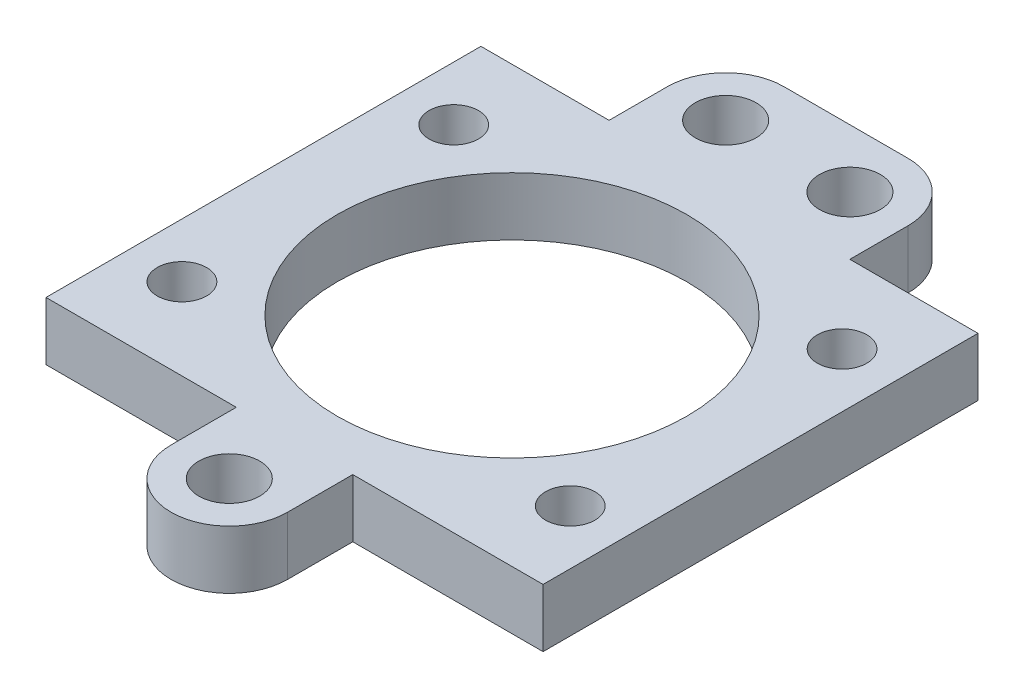
ISO-10303-21;
HEADER;
FILE_DESCRIPTION(('STEP AP214'),'2;1');
FILE_NAME('part.step','',(''),(''),'','','');
FILE_SCHEMA(('AUTOMOTIVE_DESIGN { 1 0 10303 214 1 1 1 1 }'));
ENDSEC;
DATA;
#1=APPLICATION_CONTEXT('core data for automotive mechanical design processes');
#2=APPLICATION_PROTOCOL_DEFINITION('international standard','automotive_design',2000,#1);
#3=PRODUCT_CONTEXT('',#1,'mechanical');
#4=PRODUCT('Part','Part','',(#3));
#5=PRODUCT_RELATED_PRODUCT_CATEGORY('part','',(#4));
#6=PRODUCT_DEFINITION_FORMATION('','',#4);
#7=PRODUCT_DEFINITION_CONTEXT('part definition',#1,'design');
#8=PRODUCT_DEFINITION('design','',#6,#7);
#9=PRODUCT_DEFINITION_SHAPE('','',#8);
#10=(LENGTH_UNIT() NAMED_UNIT(*) SI_UNIT(.MILLI.,.METRE.));
#11=(NAMED_UNIT(*) PLANE_ANGLE_UNIT() SI_UNIT($,.RADIAN.));
#12=(NAMED_UNIT(*) SI_UNIT($,.STERADIAN.) SOLID_ANGLE_UNIT());
#13=UNCERTAINTY_MEASURE_WITH_UNIT(LENGTH_MEASURE(1.E-05),#10,'distance_accuracy_value','');
#14=(GEOMETRIC_REPRESENTATION_CONTEXT(3) GLOBAL_UNCERTAINTY_ASSIGNED_CONTEXT((#13)) GLOBAL_UNIT_ASSIGNED_CONTEXT((#10,
#11,#12)) REPRESENTATION_CONTEXT('',''));
#15=CARTESIAN_POINT('',(0.,0.,0.));
#16=DIRECTION('',(0.,0.,1.));
#17=DIRECTION('',(1.,0.,0.));
#18=AXIS2_PLACEMENT_3D('',#15,#16,#17);
#19=CARTESIAN_POINT('',(0.,3.175,0.));
#20=DIRECTION('',(0.,1.,0.));
#21=DIRECTION('',(0.,0.,1.));
#22=AXIS2_PLACEMENT_3D('',#19,#20,#21);
#23=PLANE('',#22);
#24=CARTESIAN_POINT('',(0.,3.175,0.));
#25=DIRECTION('',(0.,-1.,0.));
#26=DIRECTION('',(0.,0.,-1.));
#27=AXIS2_PLACEMENT_3D('',#24,#25,#26);
#28=CIRCLE('',#27,14.2875);
#29=CARTESIAN_POINT('',(0.,3.175,-14.2875));
#30=VERTEX_POINT('',#29);
#31=EDGE_CURVE('E216',#30,#30,#28,.T.);
#32=ORIENTED_EDGE('',*,*,#31,.T.);
#33=EDGE_LOOP('',(#32));
#34=FACE_BOUND('',#33,.T.);
#35=CARTESIAN_POINT('',(5.08,3.175,-22.5488491058857));
#36=DIRECTION('',(0.,1.,0.));
#37=DIRECTION('',(0.,0.,1.));
#38=AXIS2_PLACEMENT_3D('',#35,#36,#37);
#39=CIRCLE('',#38,2.4892);
#40=CARTESIAN_POINT('',(5.08,3.175,-20.0596491058857));
#41=VERTEX_POINT('',#40);
#42=EDGE_CURVE('E339',#41,#41,#39,.T.);
#43=ORIENTED_EDGE('',*,*,#42,.F.);
#44=EDGE_LOOP('',(#43));
#45=FACE_BOUND('',#44,.T.);
#46=CARTESIAN_POINT('',(-5.08,3.175,-22.5488491058857));
#47=DIRECTION('',(0.,1.,0.));
#48=DIRECTION('',(0.,0.,1.));
#49=AXIS2_PLACEMENT_3D('',#46,#47,#48);
#50=CIRCLE('',#49,2.4892);
#51=CARTESIAN_POINT('',(-5.08,3.175,-20.0596491058857));
#52=VERTEX_POINT('',#51);
#53=EDGE_CURVE('E50',#52,#52,#50,.T.);
#54=ORIENTED_EDGE('',*,*,#53,.F.);
#55=EDGE_LOOP('',(#54));
#56=FACE_BOUND('',#55,.T.);
#57=CARTESIAN_POINT('',(0.,3.175,23.114));
#58=DIRECTION('',(0.,1.,0.));
#59=DIRECTION('',(0.,0.,1.));
#60=AXIS2_PLACEMENT_3D('',#57,#58,#59);
#61=CIRCLE('',#60,2.4892);
#62=CARTESIAN_POINT('',(0.,3.175,25.6032));
#63=VERTEX_POINT('',#62);
#64=EDGE_CURVE('E12',#63,#63,#61,.T.);
#65=ORIENTED_EDGE('',*,*,#64,.F.);
#66=EDGE_LOOP('',(#65));
#67=FACE_BOUND('',#66,.T.);
#68=CARTESIAN_POINT('',(-15.875,3.175,11.1125));
#69=DIRECTION('',(0.,-1.,0.));
#70=DIRECTION('',(0.,0.,-1.));
#71=AXIS2_PLACEMENT_3D('',#68,#69,#70);
#72=CIRCLE('',#71,2.0193);
#73=CARTESIAN_POINT('',(-15.875,3.175,9.0932));
#74=VERTEX_POINT('',#73);
#75=EDGE_CURVE('E329',#74,#74,#72,.T.);
#76=ORIENTED_EDGE('',*,*,#75,.T.);
#77=EDGE_LOOP('',(#76));
#78=FACE_BOUND('',#77,.T.);
#79=CARTESIAN_POINT('',(15.875,3.175,11.1125));
#80=DIRECTION('',(0.,-1.,0.));
#81=DIRECTION('',(0.,0.,-1.));
#82=AXIS2_PLACEMENT_3D('',#79,#80,#81);
#83=CIRCLE('',#82,2.0193);
#84=CARTESIAN_POINT('',(15.875,3.175,9.0932));
#85=VERTEX_POINT('',#84);
#86=EDGE_CURVE('E325',#85,#85,#83,.T.);
#87=ORIENTED_EDGE('',*,*,#86,.T.);
#88=EDGE_LOOP('',(#87));
#89=FACE_BOUND('',#88,.T.);
#90=CARTESIAN_POINT('',(15.875,3.175,-11.1125));
#91=DIRECTION('',(0.,-1.,0.));
#92=DIRECTION('',(0.,0.,-1.));
#93=AXIS2_PLACEMENT_3D('',#90,#91,#92);
#94=CIRCLE('',#93,2.0193);
#95=CARTESIAN_POINT('',(15.875,3.175,-13.1318));
#96=VERTEX_POINT('',#95);
#97=EDGE_CURVE('E330',#96,#96,#94,.T.);
#98=ORIENTED_EDGE('',*,*,#97,.T.);
#99=EDGE_LOOP('',(#98));
#100=FACE_BOUND('',#99,.T.);
#101=CARTESIAN_POINT('',(-15.875,3.175,-11.1125));
#102=DIRECTION('',(0.,-1.,0.));
#103=DIRECTION('',(0.,0.,-1.));
#104=AXIS2_PLACEMENT_3D('',#101,#102,#103);
#105=CIRCLE('',#104,2.0193);
#106=CARTESIAN_POINT('',(-15.875,3.175,-13.1318));
#107=VERTEX_POINT('',#106);
#108=EDGE_CURVE('E324',#107,#107,#105,.T.);
#109=ORIENTED_EDGE('',*,*,#108,.T.);
#110=EDGE_LOOP('',(#109));
#111=FACE_BOUND('',#110,.T.);
#112=DIRECTION('',(0.,0.,-1.));
#113=VECTOR('',#112,1.);
#114=CARTESIAN_POINT('',(-20.32,3.175,17.78));
#115=LINE('',#114,#113);
#116=CARTESIAN_POINT('',(-20.32,3.175,17.78));
#117=VERTEX_POINT('',#116);
#118=CARTESIAN_POINT('',(-20.32,3.175,-17.78));
#119=VERTEX_POINT('',#118);
#120=EDGE_CURVE('E163',#117,#119,#115,.T.);
#121=ORIENTED_EDGE('',*,*,#120,.F.);
#122=DIRECTION('',(-1.,0.,0.));
#123=VECTOR('',#122,1.);
#124=CARTESIAN_POINT('',(-20.32,3.175,17.78));
#125=LINE('',#124,#123);
#126=CARTESIAN_POINT('',(-4.7625,3.175,17.78));
#127=VERTEX_POINT('',#126);
#128=EDGE_CURVE('E58',#127,#117,#125,.T.);
#129=ORIENTED_EDGE('',*,*,#128,.F.);
#130=DIRECTION('',(0.,0.,-1.));
#131=VECTOR('',#130,1.);
#132=CARTESIAN_POINT('',(-4.7625,3.175,17.78));
#133=LINE('',#132,#131);
#134=CARTESIAN_POINT('',(-4.7625,3.175,23.114));
#135=VERTEX_POINT('',#134);
#136=EDGE_CURVE('E206',#135,#127,#133,.T.);
#137=ORIENTED_EDGE('',*,*,#136,.F.);
#138=CARTESIAN_POINT('',(0.,3.175,23.114));
#139=DIRECTION('',(0.,-1.,0.));
#140=DIRECTION('',(0.,0.,1.));
#141=AXIS2_PLACEMENT_3D('',#138,#139,#140);
#142=CIRCLE('',#141,4.7625);
#143=CARTESIAN_POINT('',(4.7625,3.175,23.114));
#144=VERTEX_POINT('',#143);
#145=EDGE_CURVE('E202',#144,#135,#142,.T.);
#146=ORIENTED_EDGE('',*,*,#145,.F.);
#147=DIRECTION('',(0.,0.,1.));
#148=VECTOR('',#147,1.);
#149=CARTESIAN_POINT('',(4.7625,3.175,23.114));
#150=LINE('',#149,#148);
#151=CARTESIAN_POINT('',(4.7625,3.175,17.78));
#152=VERTEX_POINT('',#151);
#153=EDGE_CURVE('E198',#152,#144,#150,.T.);
#154=ORIENTED_EDGE('',*,*,#153,.F.);
#155=DIRECTION('',(-1.,0.,0.));
#156=VECTOR('',#155,1.);
#157=CARTESIAN_POINT('',(4.7625,3.175,17.78));
#158=LINE('',#157,#156);
#159=CARTESIAN_POINT('',(20.32,3.175,17.78));
#160=VERTEX_POINT('',#159);
#161=EDGE_CURVE('E194',#160,#152,#158,.T.);
#162=ORIENTED_EDGE('',*,*,#161,.F.);
#163=DIRECTION('',(0.,0.,1.));
#164=VECTOR('',#163,1.);
#165=CARTESIAN_POINT('',(20.32,3.175,-17.78));
#166=LINE('',#165,#164);
#167=CARTESIAN_POINT('',(20.32,3.175,-17.78));
#168=VERTEX_POINT('',#167);
#169=EDGE_CURVE('E190',#168,#160,#166,.T.);
#170=ORIENTED_EDGE('',*,*,#169,.F.);
#171=DIRECTION('',(1.,0.,0.));
#172=VECTOR('',#171,1.);
#173=CARTESIAN_POINT('',(9.8425,3.175,-17.78));
#174=LINE('',#173,#172);
#175=CARTESIAN_POINT('',(9.8425,3.175,-17.78));
#176=VERTEX_POINT('',#175);
#177=EDGE_CURVE('E186',#176,#168,#174,.T.);
#178=ORIENTED_EDGE('',*,*,#177,.F.);
#179=DIRECTION('',(0.,0.,1.));
#180=VECTOR('',#179,1.);
#181=CARTESIAN_POINT('',(9.8425,3.175,-22.5488491058857));
#182=LINE('',#181,#180);
#183=CARTESIAN_POINT('',(9.8425,3.175,-22.5488491058857));
#184=VERTEX_POINT('',#183);
#185=EDGE_CURVE('E182',#184,#176,#182,.T.);
#186=ORIENTED_EDGE('',*,*,#185,.F.);
#187=CARTESIAN_POINT('',(5.08,3.175,-22.5488491058857));
#188=DIRECTION('',(0.,-1.,0.));
#189=DIRECTION('',(0.,0.,-1.));
#190=AXIS2_PLACEMENT_3D('',#187,#188,#189);
#191=CIRCLE('',#190,4.7625);
#192=CARTESIAN_POINT('',(5.08,3.175,-27.3113491058857));
#193=VERTEX_POINT('',#192);
#194=EDGE_CURVE('E178',#193,#184,#191,.T.);
#195=ORIENTED_EDGE('',*,*,#194,.F.);
#196=DIRECTION('',(1.,0.,0.));
#197=VECTOR('',#196,1.);
#198=CARTESIAN_POINT('',(-5.08,3.175,-27.3113491058857));
#199=LINE('',#198,#197);
#200=CARTESIAN_POINT('',(-5.08,3.175,-27.3113491058857));
#201=VERTEX_POINT('',#200);
#202=EDGE_CURVE('E171',#201,#193,#199,.T.);
#203=ORIENTED_EDGE('',*,*,#202,.F.);
#204=CARTESIAN_POINT('',(-5.08,3.175,-22.5488491058857));
#205=DIRECTION('',(0.,-1.,0.));
#206=DIRECTION('',(0.,0.,1.));
#207=AXIS2_PLACEMENT_3D('',#204,#205,#206);
#208=CIRCLE('',#207,4.7625);
#209=CARTESIAN_POINT('',(-9.8425,3.175,-22.5488491058857));
#210=VERTEX_POINT('',#209);
#211=EDGE_CURVE('E167',#210,#201,#208,.T.);
#212=ORIENTED_EDGE('',*,*,#211,.F.);
#213=DIRECTION('',(0.,0.,-1.));
#214=VECTOR('',#213,1.);
#215=CARTESIAN_POINT('',(-9.84250000000001,3.175,-17.78));
#216=LINE('',#215,#214);
#217=CARTESIAN_POINT('',(-9.84250000000001,3.175,-17.78));
#218=VERTEX_POINT('',#217);
#219=EDGE_CURVE('E148',#218,#210,#216,.T.);
#220=ORIENTED_EDGE('',*,*,#219,.F.);
#221=DIRECTION('',(1.,0.,0.));
#222=VECTOR('',#221,1.);
#223=CARTESIAN_POINT('',(-20.32,3.175,-17.78));
#224=LINE('',#223,#222);
#225=EDGE_CURVE('E157',#119,#218,#224,.T.);
#226=ORIENTED_EDGE('',*,*,#225,.F.);
#227=EDGE_LOOP('',(#121,#129,#137,#146,#154,#162,#170,#178,#186,#195,#203,#212,#220,#226));
#228=FACE_BOUND('',#227,.T.);
#229=ADVANCED_FACE('F41',(#34,#45,#56,#67,#78,#89,#100,#111,#228),#23,.T.);
#230=CARTESIAN_POINT('',(0.,-1.5875,0.));
#231=DIRECTION('',(0.,1.,0.));
#232=DIRECTION('',(0.,0.,1.));
#233=AXIS2_PLACEMENT_3D('',#230,#231,#232);
#234=PLANE('',#233);
#235=CARTESIAN_POINT('',(0.,-1.5875,0.));
#236=DIRECTION('',(0.,-1.,0.));
#237=DIRECTION('',(0.,0.,-1.));
#238=AXIS2_PLACEMENT_3D('',#235,#236,#237);
#239=CIRCLE('',#238,14.2875);
#240=CARTESIAN_POINT('',(0.,-1.5875,-14.2875));
#241=VERTEX_POINT('',#240);
#242=EDGE_CURVE('E425',#241,#241,#239,.T.);
#243=ORIENTED_EDGE('',*,*,#242,.F.);
#244=EDGE_LOOP('',(#243));
#245=FACE_BOUND('',#244,.T.);
#246=CARTESIAN_POINT('',(5.08,-1.5875,-22.5488491058857));
#247=DIRECTION('',(0.,1.,0.));
#248=DIRECTION('',(0.,0.,1.));
#249=AXIS2_PLACEMENT_3D('',#246,#247,#248);
#250=CIRCLE('',#249,2.4892);
#251=CARTESIAN_POINT('',(5.08,-1.5875,-20.0596491058857));
#252=VERTEX_POINT('',#251);
#253=EDGE_CURVE('E320',#252,#252,#250,.F.);
#254=ORIENTED_EDGE('',*,*,#253,.F.);
#255=EDGE_LOOP('',(#254));
#256=FACE_BOUND('',#255,.T.);
#257=CARTESIAN_POINT('',(0.,-1.5875,23.114));
#258=DIRECTION('',(0.,1.,0.));
#259=DIRECTION('',(0.,0.,1.));
#260=AXIS2_PLACEMENT_3D('',#257,#258,#259);
#261=CIRCLE('',#260,2.4892);
#262=CARTESIAN_POINT('',(0.,-1.5875,25.6032));
#263=VERTEX_POINT('',#262);
#264=EDGE_CURVE('E312',#263,#263,#261,.F.);
#265=ORIENTED_EDGE('',*,*,#264,.F.);
#266=EDGE_LOOP('',(#265));
#267=FACE_BOUND('',#266,.T.);
#268=CARTESIAN_POINT('',(15.875,-1.5875,11.1125));
#269=DIRECTION('',(0.,1.,0.));
#270=DIRECTION('',(0.,0.,1.));
#271=AXIS2_PLACEMENT_3D('',#268,#269,#270);
#272=CIRCLE('',#271,2.0193);
#273=CARTESIAN_POINT('',(15.875,-1.5875,13.1318));
#274=VERTEX_POINT('',#273);
#275=EDGE_CURVE('E304',#274,#274,#272,.F.);
#276=ORIENTED_EDGE('',*,*,#275,.F.);
#277=EDGE_LOOP('',(#276));
#278=FACE_BOUND('',#277,.T.);
#279=CARTESIAN_POINT('',(-15.875,-1.5875,-11.1125));
#280=DIRECTION('',(0.,1.,0.));
#281=DIRECTION('',(0.,0.,1.));
#282=AXIS2_PLACEMENT_3D('',#279,#280,#281);
#283=CIRCLE('',#282,2.0193);
#284=CARTESIAN_POINT('',(-15.875,-1.5875,-9.0932));
#285=VERTEX_POINT('',#284);
#286=EDGE_CURVE('E44',#285,#285,#283,.F.);
#287=ORIENTED_EDGE('',*,*,#286,.F.);
#288=EDGE_LOOP('',(#287));
#289=FACE_BOUND('',#288,.T.);
#290=CARTESIAN_POINT('',(15.875,-1.5875,-11.1125));
#291=DIRECTION('',(0.,1.,0.));
#292=DIRECTION('',(0.,0.,1.));
#293=AXIS2_PLACEMENT_3D('',#290,#291,#292);
#294=CIRCLE('',#293,2.0193);
#295=CARTESIAN_POINT('',(15.875,-1.5875,-9.09319999999999));
#296=VERTEX_POINT('',#295);
#297=EDGE_CURVE('E300',#296,#296,#294,.F.);
#298=ORIENTED_EDGE('',*,*,#297,.F.);
#299=EDGE_LOOP('',(#298));
#300=FACE_BOUND('',#299,.T.);
#301=CARTESIAN_POINT('',(-15.875,-1.5875,11.1125));
#302=DIRECTION('',(0.,1.,0.));
#303=DIRECTION('',(0.,0.,1.));
#304=AXIS2_PLACEMENT_3D('',#301,#302,#303);
#305=CIRCLE('',#304,2.0193);
#306=CARTESIAN_POINT('',(-15.875,-1.5875,13.1318));
#307=VERTEX_POINT('',#306);
#308=EDGE_CURVE('E308',#307,#307,#305,.F.);
#309=ORIENTED_EDGE('',*,*,#308,.F.);
#310=EDGE_LOOP('',(#309));
#311=FACE_BOUND('',#310,.T.);
#312=CARTESIAN_POINT('',(-5.08,-1.5875,-22.5488491058857));
#313=DIRECTION('',(0.,1.,0.));
#314=DIRECTION('',(0.,0.,1.));
#315=AXIS2_PLACEMENT_3D('',#312,#313,#314);
#316=CIRCLE('',#315,2.4892);
#317=CARTESIAN_POINT('',(-5.08,-1.5875,-20.0596491058857));
#318=VERTEX_POINT('',#317);
#319=EDGE_CURVE('E316',#318,#318,#316,.F.);
#320=ORIENTED_EDGE('',*,*,#319,.F.);
#321=EDGE_LOOP('',(#320));
#322=FACE_BOUND('',#321,.T.);
#323=DIRECTION('',(-1.,0.,0.));
#324=VECTOR('',#323,1.);
#325=CARTESIAN_POINT('',(-20.32,-1.5875,17.78));
#326=LINE('',#325,#324);
#327=CARTESIAN_POINT('',(-4.7625,-1.5875,17.78));
#328=VERTEX_POINT('',#327);
#329=CARTESIAN_POINT('',(-20.32,-1.5875,17.78));
#330=VERTEX_POINT('',#329);
#331=EDGE_CURVE('E211',#328,#330,#326,.T.);
#332=ORIENTED_EDGE('',*,*,#331,.T.);
#333=DIRECTION('',(0.,0.,-1.));
#334=VECTOR('',#333,1.);
#335=CARTESIAN_POINT('',(-20.32,-1.5875,17.78));
#336=LINE('',#335,#334);
#337=CARTESIAN_POINT('',(-20.32,-1.5875,-17.78));
#338=VERTEX_POINT('',#337);
#339=EDGE_CURVE('E215',#330,#338,#336,.T.);
#340=ORIENTED_EDGE('',*,*,#339,.T.);
#341=DIRECTION('',(1.,0.,0.));
#342=VECTOR('',#341,1.);
#343=CARTESIAN_POINT('',(-20.32,-1.5875,-17.78));
#344=LINE('',#343,#342);
#345=CARTESIAN_POINT('',(-9.84250000000001,-1.5875,-17.78));
#346=VERTEX_POINT('',#345);
#347=EDGE_CURVE('E66',#338,#346,#344,.T.);
#348=ORIENTED_EDGE('',*,*,#347,.T.);
#349=DIRECTION('',(0.,0.,-1.));
#350=VECTOR('',#349,1.);
#351=CARTESIAN_POINT('',(-9.84250000000001,-1.5875,-17.78));
#352=LINE('',#351,#350);
#353=CARTESIAN_POINT('',(-9.8425,-1.5875,-22.5488491058857));
#354=VERTEX_POINT('',#353);
#355=EDGE_CURVE('E151',#346,#354,#352,.T.);
#356=ORIENTED_EDGE('',*,*,#355,.T.);
#357=CARTESIAN_POINT('',(-5.08,-1.5875,-22.5488491058857));
#358=DIRECTION('',(0.,-1.,0.));
#359=DIRECTION('',(0.,0.,1.));
#360=AXIS2_PLACEMENT_3D('',#357,#358,#359);
#361=CIRCLE('',#360,4.7625);
#362=CARTESIAN_POINT('',(-5.08,-1.5875,-27.3113491058857));
#363=VERTEX_POINT('',#362);
#364=EDGE_CURVE('E224',#354,#363,#361,.T.);
#365=ORIENTED_EDGE('',*,*,#364,.T.);
#366=DIRECTION('',(1.,0.,0.));
#367=VECTOR('',#366,1.);
#368=CARTESIAN_POINT('',(-5.08,-1.5875,-27.3113491058857));
#369=LINE('',#368,#367);
#370=CARTESIAN_POINT('',(5.08,-1.5875,-27.3113491058857));
#371=VERTEX_POINT('',#370);
#372=EDGE_CURVE('E228',#363,#371,#369,.T.);
#373=ORIENTED_EDGE('',*,*,#372,.T.);
#374=CARTESIAN_POINT('',(5.08,-1.5875,-22.5488491058857));
#375=DIRECTION('',(0.,-1.,0.));
#376=DIRECTION('',(0.,0.,-1.));
#377=AXIS2_PLACEMENT_3D('',#374,#375,#376);
#378=CIRCLE('',#377,4.7625);
#379=CARTESIAN_POINT('',(9.8425,-1.5875,-22.5488491058857));
#380=VERTEX_POINT('',#379);
#381=EDGE_CURVE('E232',#371,#380,#378,.T.);
#382=ORIENTED_EDGE('',*,*,#381,.T.);
#383=DIRECTION('',(0.,0.,1.));
#384=VECTOR('',#383,1.);
#385=CARTESIAN_POINT('',(9.8425,-1.5875,-22.5488491058857));
#386=LINE('',#385,#384);
#387=CARTESIAN_POINT('',(9.8425,-1.5875,-17.78));
#388=VERTEX_POINT('',#387);
#389=EDGE_CURVE('E236',#380,#388,#386,.T.);
#390=ORIENTED_EDGE('',*,*,#389,.T.);
#391=DIRECTION('',(1.,0.,0.));
#392=VECTOR('',#391,1.);
#393=CARTESIAN_POINT('',(9.8425,-1.5875,-17.78));
#394=LINE('',#393,#392);
#395=CARTESIAN_POINT('',(20.32,-1.5875,-17.78));
#396=VERTEX_POINT('',#395);
#397=EDGE_CURVE('E240',#388,#396,#394,.T.);
#398=ORIENTED_EDGE('',*,*,#397,.T.);
#399=DIRECTION('',(0.,0.,1.));
#400=VECTOR('',#399,1.);
#401=CARTESIAN_POINT('',(20.32,-1.5875,-17.78));
#402=LINE('',#401,#400);
#403=CARTESIAN_POINT('',(20.32,-1.5875,17.78));
#404=VERTEX_POINT('',#403);
#405=EDGE_CURVE('E244',#396,#404,#402,.T.);
#406=ORIENTED_EDGE('',*,*,#405,.T.);
#407=DIRECTION('',(-1.,0.,0.));
#408=VECTOR('',#407,1.);
#409=CARTESIAN_POINT('',(4.7625,-1.5875,17.78));
#410=LINE('',#409,#408);
#411=CARTESIAN_POINT('',(4.7625,-1.5875,17.78));
#412=VERTEX_POINT('',#411);
#413=EDGE_CURVE('E248',#404,#412,#410,.T.);
#414=ORIENTED_EDGE('',*,*,#413,.T.);
#415=DIRECTION('',(0.,0.,1.));
#416=VECTOR('',#415,1.);
#417=CARTESIAN_POINT('',(4.7625,-1.5875,23.114));
#418=LINE('',#417,#416);
#419=CARTESIAN_POINT('',(4.7625,-1.5875,23.114));
#420=VERTEX_POINT('',#419);
#421=EDGE_CURVE('E252',#412,#420,#418,.T.);
#422=ORIENTED_EDGE('',*,*,#421,.T.);
#423=CARTESIAN_POINT('',(0.,-1.5875,23.114));
#424=DIRECTION('',(0.,-1.,0.));
#425=DIRECTION('',(0.,0.,1.));
#426=AXIS2_PLACEMENT_3D('',#423,#424,#425);
#427=CIRCLE('',#426,4.7625);
#428=CARTESIAN_POINT('',(-4.7625,-1.5875,23.114));
#429=VERTEX_POINT('',#428);
#430=EDGE_CURVE('E256',#420,#429,#427,.T.);
#431=ORIENTED_EDGE('',*,*,#430,.T.);
#432=DIRECTION('',(0.,0.,-1.));
#433=VECTOR('',#432,1.);
#434=CARTESIAN_POINT('',(-4.7625,-1.5875,17.78));
#435=LINE('',#434,#433);
#436=EDGE_CURVE('E260',#429,#328,#435,.T.);
#437=ORIENTED_EDGE('',*,*,#436,.T.);
#438=EDGE_LOOP('',(#332,#340,#348,#356,#365,#373,#382,#390,#398,#406,#414,#422,#431,#437));
#439=FACE_BOUND('',#438,.T.);
#440=ADVANCED_FACE('F351',(#245,#256,#267,#278,#289,#300,#311,#322,#439),#234,.F.);
#441=CARTESIAN_POINT('',(5.08,-3.175,-22.5488491058857));
#442=DIRECTION('',(0.,1.,0.));
#443=DIRECTION('',(0.,0.,1.));
#444=AXIS2_PLACEMENT_3D('',#441,#442,#443);
#445=CYLINDRICAL_SURFACE('',#444,2.4892);
#446=ORIENTED_EDGE('',*,*,#253,.T.);
#447=EDGE_LOOP('',(#446));
#448=FACE_BOUND('',#447,.T.);
#449=ORIENTED_EDGE('',*,*,#42,.T.);
#450=EDGE_LOOP('',(#449));
#451=FACE_BOUND('',#450,.T.);
#452=ADVANCED_FACE('F347',(#448,#451),#445,.F.);
#453=CARTESIAN_POINT('',(-5.08,-3.175,-22.5488491058857));
#454=DIRECTION('',(0.,1.,0.));
#455=DIRECTION('',(0.,0.,1.));
#456=AXIS2_PLACEMENT_3D('',#453,#454,#455);
#457=CYLINDRICAL_SURFACE('',#456,2.4892);
#458=ORIENTED_EDGE('',*,*,#319,.T.);
#459=EDGE_LOOP('',(#458));
#460=FACE_BOUND('',#459,.T.);
#461=ORIENTED_EDGE('',*,*,#53,.T.);
#462=EDGE_LOOP('',(#461));
#463=FACE_BOUND('',#462,.T.);
#464=ADVANCED_FACE('F390',(#460,#463),#457,.F.);
#465=CARTESIAN_POINT('',(0.,-3.175,23.114));
#466=DIRECTION('',(0.,1.,0.));
#467=DIRECTION('',(0.,0.,1.));
#468=AXIS2_PLACEMENT_3D('',#465,#466,#467);
#469=CYLINDRICAL_SURFACE('',#468,2.4892);
#470=ORIENTED_EDGE('',*,*,#264,.T.);
#471=EDGE_LOOP('',(#470));
#472=FACE_BOUND('',#471,.T.);
#473=ORIENTED_EDGE('',*,*,#64,.T.);
#474=EDGE_LOOP('',(#473));
#475=FACE_BOUND('',#474,.T.);
#476=ADVANCED_FACE('F386',(#472,#475),#469,.F.);
#477=CARTESIAN_POINT('',(-15.875,3.175,11.1125));
#478=DIRECTION('',(0.,-1.,0.));
#479=DIRECTION('',(0.,0.,-1.));
#480=AXIS2_PLACEMENT_3D('',#477,#478,#479);
#481=CYLINDRICAL_SURFACE('',#480,2.0193);
#482=ORIENTED_EDGE('',*,*,#308,.T.);
#483=EDGE_LOOP('',(#482));
#484=FACE_BOUND('',#483,.T.);
#485=ORIENTED_EDGE('',*,*,#75,.F.);
#486=EDGE_LOOP('',(#485));
#487=FACE_BOUND('',#486,.T.);
#488=ADVANCED_FACE('F383',(#484,#487),#481,.F.);
#489=CARTESIAN_POINT('',(15.875,3.175,11.1125));
#490=DIRECTION('',(0.,-1.,0.));
#491=DIRECTION('',(0.,0.,-1.));
#492=AXIS2_PLACEMENT_3D('',#489,#490,#491);
#493=CYLINDRICAL_SURFACE('',#492,2.0193);
#494=ORIENTED_EDGE('',*,*,#275,.T.);
#495=EDGE_LOOP('',(#494));
#496=FACE_BOUND('',#495,.T.);
#497=ORIENTED_EDGE('',*,*,#86,.F.);
#498=EDGE_LOOP('',(#497));
#499=FACE_BOUND('',#498,.T.);
#500=ADVANCED_FACE('F377',(#496,#499),#493,.F.);
#501=CARTESIAN_POINT('',(15.875,3.175,-11.1125));
#502=DIRECTION('',(0.,-1.,0.));
#503=DIRECTION('',(0.,0.,-1.));
#504=AXIS2_PLACEMENT_3D('',#501,#502,#503);
#505=CYLINDRICAL_SURFACE('',#504,2.0193);
#506=ORIENTED_EDGE('',*,*,#297,.T.);
#507=EDGE_LOOP('',(#506));
#508=FACE_BOUND('',#507,.T.);
#509=ORIENTED_EDGE('',*,*,#97,.F.);
#510=EDGE_LOOP('',(#509));
#511=FACE_BOUND('',#510,.T.);
#512=ADVANCED_FACE('F368',(#508,#511),#505,.F.);
#513=CARTESIAN_POINT('',(-15.875,3.175,-11.1125));
#514=DIRECTION('',(0.,-1.,0.));
#515=DIRECTION('',(0.,0.,-1.));
#516=AXIS2_PLACEMENT_3D('',#513,#514,#515);
#517=CYLINDRICAL_SURFACE('',#516,2.0193);
#518=ORIENTED_EDGE('',*,*,#286,.T.);
#519=EDGE_LOOP('',(#518));
#520=FACE_BOUND('',#519,.T.);
#521=ORIENTED_EDGE('',*,*,#108,.F.);
#522=EDGE_LOOP('',(#521));
#523=FACE_BOUND('',#522,.T.);
#524=ADVANCED_FACE('F365',(#520,#523),#517,.F.);
#525=CARTESIAN_POINT('',(-20.32,3.175,17.78));
#526=DIRECTION('',(0.,0.,1.));
#527=DIRECTION('',(1.,0.,0.));
#528=AXIS2_PLACEMENT_3D('',#525,#526,#527);
#529=PLANE('',#528);
#530=ORIENTED_EDGE('',*,*,#331,.F.);
#531=DIRECTION('',(0.,-1.,0.));
#532=VECTOR('',#531,1.);
#533=CARTESIAN_POINT('',(-4.7625,3.175,17.78));
#534=LINE('',#533,#532);
#535=EDGE_CURVE('E264',#127,#328,#534,.T.);
#536=ORIENTED_EDGE('',*,*,#535,.F.);
#537=ORIENTED_EDGE('',*,*,#128,.T.);
#538=DIRECTION('',(0.,-1.,0.));
#539=VECTOR('',#538,1.);
#540=CARTESIAN_POINT('',(-20.32,3.175,17.78));
#541=LINE('',#540,#539);
#542=EDGE_CURVE('E210',#117,#330,#541,.T.);
#543=ORIENTED_EDGE('',*,*,#542,.T.);
#544=EDGE_LOOP('',(#530,#536,#537,#543));
#545=FACE_BOUND('',#544,.T.);
#546=ADVANCED_FACE('F367',(#545),#529,.T.);
#547=CARTESIAN_POINT('',(-4.7625,3.175,17.78));
#548=DIRECTION('',(-1.,0.,0.));
#549=DIRECTION('',(0.,0.,1.));
#550=AXIS2_PLACEMENT_3D('',#547,#548,#549);
#551=PLANE('',#550);
#552=ORIENTED_EDGE('',*,*,#436,.F.);
#553=DIRECTION('',(0.,-1.,0.));
#554=VECTOR('',#553,1.);
#555=CARTESIAN_POINT('',(-4.7625,3.175,23.114));
#556=LINE('',#555,#554);
#557=EDGE_CURVE('E267',#135,#429,#556,.T.);
#558=ORIENTED_EDGE('',*,*,#557,.F.);
#559=ORIENTED_EDGE('',*,*,#136,.T.);
#560=ORIENTED_EDGE('',*,*,#535,.T.);
#561=EDGE_LOOP('',(#552,#558,#559,#560));
#562=FACE_BOUND('',#561,.T.);
#563=ADVANCED_FACE('F375',(#562),#551,.T.);
#564=CARTESIAN_POINT('',(0.,3.175,23.114));
#565=DIRECTION('',(0.,-1.,0.));
#566=DIRECTION('',(0.,0.,-1.));
#567=AXIS2_PLACEMENT_3D('',#564,#565,#566);
#568=CYLINDRICAL_SURFACE('',#567,4.7625);
#569=ORIENTED_EDGE('',*,*,#430,.F.);
#570=DIRECTION('',(0.,-1.,0.));
#571=VECTOR('',#570,1.);
#572=CARTESIAN_POINT('',(4.7625,3.175,23.114));
#573=LINE('',#572,#571);
#574=EDGE_CURVE('E270',#144,#420,#573,.T.);
#575=ORIENTED_EDGE('',*,*,#574,.F.);
#576=ORIENTED_EDGE('',*,*,#145,.T.);
#577=ORIENTED_EDGE('',*,*,#557,.T.);
#578=EDGE_LOOP('',(#569,#575,#576,#577));
#579=FACE_BOUND('',#578,.T.);
#580=ADVANCED_FACE('F445',(#579),#568,.T.);
#581=CARTESIAN_POINT('',(4.7625,3.175,23.114));
#582=DIRECTION('',(1.,0.,0.));
#583=DIRECTION('',(0.,0.,-1.));
#584=AXIS2_PLACEMENT_3D('',#581,#582,#583);
#585=PLANE('',#584);
#586=ORIENTED_EDGE('',*,*,#421,.F.);
#587=DIRECTION('',(0.,-1.,0.));
#588=VECTOR('',#587,1.);
#589=CARTESIAN_POINT('',(4.7625,3.175,17.78));
#590=LINE('',#589,#588);
#591=EDGE_CURVE('E273',#152,#412,#590,.T.);
#592=ORIENTED_EDGE('',*,*,#591,.F.);
#593=ORIENTED_EDGE('',*,*,#153,.T.);
#594=ORIENTED_EDGE('',*,*,#574,.T.);
#595=EDGE_LOOP('',(#586,#592,#593,#594));
#596=FACE_BOUND('',#595,.T.);
#597=ADVANCED_FACE('F449',(#596),#585,.T.);
#598=CARTESIAN_POINT('',(4.7625,3.175,17.78));
#599=DIRECTION('',(0.,0.,1.));
#600=DIRECTION('',(1.,0.,0.));
#601=AXIS2_PLACEMENT_3D('',#598,#599,#600);
#602=PLANE('',#601);
#603=ORIENTED_EDGE('',*,*,#413,.F.);
#604=DIRECTION('',(0.,-1.,0.));
#605=VECTOR('',#604,1.);
#606=CARTESIAN_POINT('',(20.32,3.175,17.78));
#607=LINE('',#606,#605);
#608=EDGE_CURVE('E276',#160,#404,#607,.T.);
#609=ORIENTED_EDGE('',*,*,#608,.F.);
#610=ORIENTED_EDGE('',*,*,#161,.T.);
#611=ORIENTED_EDGE('',*,*,#591,.T.);
#612=EDGE_LOOP('',(#603,#609,#610,#611));
#613=FACE_BOUND('',#612,.T.);
#614=ADVANCED_FACE('F453',(#613),#602,.T.);
#615=CARTESIAN_POINT('',(20.32,3.175,-17.78));
#616=DIRECTION('',(1.,0.,0.));
#617=DIRECTION('',(0.,0.,-1.));
#618=AXIS2_PLACEMENT_3D('',#615,#616,#617);
#619=PLANE('',#618);
#620=ORIENTED_EDGE('',*,*,#405,.F.);
#621=DIRECTION('',(0.,-1.,0.));
#622=VECTOR('',#621,1.);
#623=CARTESIAN_POINT('',(20.32,3.175,-17.78));
#624=LINE('',#623,#622);
#625=EDGE_CURVE('E279',#168,#396,#624,.T.);
#626=ORIENTED_EDGE('',*,*,#625,.F.);
#627=ORIENTED_EDGE('',*,*,#169,.T.);
#628=ORIENTED_EDGE('',*,*,#608,.T.);
#629=EDGE_LOOP('',(#620,#626,#627,#628));
#630=FACE_BOUND('',#629,.T.);
#631=ADVANCED_FACE('F457',(#630),#619,.T.);
#632=CARTESIAN_POINT('',(9.8425,3.175,-17.78));
#633=DIRECTION('',(0.,0.,-1.));
#634=DIRECTION('',(-1.,0.,0.));
#635=AXIS2_PLACEMENT_3D('',#632,#633,#634);
#636=PLANE('',#635);
#637=ORIENTED_EDGE('',*,*,#397,.F.);
#638=DIRECTION('',(0.,-1.,0.));
#639=VECTOR('',#638,1.);
#640=CARTESIAN_POINT('',(9.8425,3.175,-17.78));
#641=LINE('',#640,#639);
#642=EDGE_CURVE('E282',#176,#388,#641,.T.);
#643=ORIENTED_EDGE('',*,*,#642,.F.);
#644=ORIENTED_EDGE('',*,*,#177,.T.);
#645=ORIENTED_EDGE('',*,*,#625,.T.);
#646=EDGE_LOOP('',(#637,#643,#644,#645));
#647=FACE_BOUND('',#646,.T.);
#648=ADVANCED_FACE('F461',(#647),#636,.T.);
#649=CARTESIAN_POINT('',(9.8425,3.175,-22.5488491058857));
#650=DIRECTION('',(1.,0.,0.));
#651=DIRECTION('',(0.,0.,-1.));
#652=AXIS2_PLACEMENT_3D('',#649,#650,#651);
#653=PLANE('',#652);
#654=ORIENTED_EDGE('',*,*,#389,.F.);
#655=DIRECTION('',(0.,-1.,0.));
#656=VECTOR('',#655,1.);
#657=CARTESIAN_POINT('',(9.8425,3.175,-22.5488491058857));
#658=LINE('',#657,#656);
#659=EDGE_CURVE('E285',#184,#380,#658,.T.);
#660=ORIENTED_EDGE('',*,*,#659,.F.);
#661=ORIENTED_EDGE('',*,*,#185,.T.);
#662=ORIENTED_EDGE('',*,*,#642,.T.);
#663=EDGE_LOOP('',(#654,#660,#661,#662));
#664=FACE_BOUND('',#663,.T.);
#665=ADVANCED_FACE('F465',(#664),#653,.T.);
#666=CARTESIAN_POINT('',(5.08,3.175,-22.5488491058857));
#667=DIRECTION('',(0.,-1.,0.));
#668=DIRECTION('',(0.,0.,-1.));
#669=AXIS2_PLACEMENT_3D('',#666,#667,#668);
#670=CYLINDRICAL_SURFACE('',#669,4.7625);
#671=ORIENTED_EDGE('',*,*,#381,.F.);
#672=DIRECTION('',(0.,-1.,0.));
#673=VECTOR('',#672,1.);
#674=CARTESIAN_POINT('',(5.08,3.175,-27.3113491058857));
#675=LINE('',#674,#673);
#676=EDGE_CURVE('E288',#193,#371,#675,.T.);
#677=ORIENTED_EDGE('',*,*,#676,.F.);
#678=ORIENTED_EDGE('',*,*,#194,.T.);
#679=ORIENTED_EDGE('',*,*,#659,.T.);
#680=EDGE_LOOP('',(#671,#677,#678,#679));
#681=FACE_BOUND('',#680,.T.);
#682=ADVANCED_FACE('F469',(#681),#670,.T.);
#683=CARTESIAN_POINT('',(-5.08,3.175,-27.3113491058857));
#684=DIRECTION('',(0.,0.,-1.));
#685=DIRECTION('',(-1.,0.,0.));
#686=AXIS2_PLACEMENT_3D('',#683,#684,#685);
#687=PLANE('',#686);
#688=ORIENTED_EDGE('',*,*,#372,.F.);
#689=DIRECTION('',(0.,-1.,0.));
#690=VECTOR('',#689,1.);
#691=CARTESIAN_POINT('',(-5.08,3.175,-27.3113491058857));
#692=LINE('',#691,#690);
#693=EDGE_CURVE('E291',#201,#363,#692,.T.);
#694=ORIENTED_EDGE('',*,*,#693,.F.);
#695=ORIENTED_EDGE('',*,*,#202,.T.);
#696=ORIENTED_EDGE('',*,*,#676,.T.);
#697=EDGE_LOOP('',(#688,#694,#695,#696));
#698=FACE_BOUND('',#697,.T.);
#699=ADVANCED_FACE('F473',(#698),#687,.T.);
#700=CARTESIAN_POINT('',(-5.08,3.175,-22.5488491058857));
#701=DIRECTION('',(0.,-1.,0.));
#702=DIRECTION('',(0.,0.,-1.));
#703=AXIS2_PLACEMENT_3D('',#700,#701,#702);
#704=CYLINDRICAL_SURFACE('',#703,4.7625);
#705=ORIENTED_EDGE('',*,*,#364,.F.);
#706=DIRECTION('',(0.,-1.,0.));
#707=VECTOR('',#706,1.);
#708=CARTESIAN_POINT('',(-9.8425,3.175,-22.5488491058857));
#709=LINE('',#708,#707);
#710=EDGE_CURVE('E153',#210,#354,#709,.T.);
#711=ORIENTED_EDGE('',*,*,#710,.F.);
#712=ORIENTED_EDGE('',*,*,#211,.T.);
#713=ORIENTED_EDGE('',*,*,#693,.T.);
#714=EDGE_LOOP('',(#705,#711,#712,#713));
#715=FACE_BOUND('',#714,.T.);
#716=ADVANCED_FACE('F477',(#715),#704,.T.);
#717=CARTESIAN_POINT('',(-9.84250000000001,3.175,-17.78));
#718=DIRECTION('',(-1.,0.,0.));
#719=DIRECTION('',(0.,0.,1.));
#720=AXIS2_PLACEMENT_3D('',#717,#718,#719);
#721=PLANE('',#720);
#722=ORIENTED_EDGE('',*,*,#355,.F.);
#723=DIRECTION('',(0.,-1.,0.));
#724=VECTOR('',#723,1.);
#725=CARTESIAN_POINT('',(-9.84250000000001,3.175,-17.78));
#726=LINE('',#725,#724);
#727=EDGE_CURVE('E144',#218,#346,#726,.T.);
#728=ORIENTED_EDGE('',*,*,#727,.F.);
#729=ORIENTED_EDGE('',*,*,#219,.T.);
#730=ORIENTED_EDGE('',*,*,#710,.T.);
#731=EDGE_LOOP('',(#722,#728,#729,#730));
#732=FACE_BOUND('',#731,.T.);
#733=ADVANCED_FACE('F146',(#732),#721,.T.);
#734=CARTESIAN_POINT('',(-20.32,3.175,-17.78));
#735=DIRECTION('',(0.,0.,-1.));
#736=DIRECTION('',(-1.,0.,0.));
#737=AXIS2_PLACEMENT_3D('',#734,#735,#736);
#738=PLANE('',#737);
#739=ORIENTED_EDGE('',*,*,#347,.F.);
#740=DIRECTION('',(0.,-1.,0.));
#741=VECTOR('',#740,1.);
#742=CARTESIAN_POINT('',(-20.32,3.175,-17.78));
#743=LINE('',#742,#741);
#744=EDGE_CURVE('E154',#119,#338,#743,.T.);
#745=ORIENTED_EDGE('',*,*,#744,.F.);
#746=ORIENTED_EDGE('',*,*,#225,.T.);
#747=ORIENTED_EDGE('',*,*,#727,.T.);
#748=EDGE_LOOP('',(#739,#745,#746,#747));
#749=FACE_BOUND('',#748,.T.);
#750=ADVANCED_FACE('F158',(#749),#738,.T.);
#751=CARTESIAN_POINT('',(-20.32,3.175,17.78));
#752=DIRECTION('',(-1.,0.,0.));
#753=DIRECTION('',(0.,0.,1.));
#754=AXIS2_PLACEMENT_3D('',#751,#752,#753);
#755=PLANE('',#754);
#756=ORIENTED_EDGE('',*,*,#339,.F.);
#757=ORIENTED_EDGE('',*,*,#542,.F.);
#758=ORIENTED_EDGE('',*,*,#120,.T.);
#759=ORIENTED_EDGE('',*,*,#744,.T.);
#760=EDGE_LOOP('',(#756,#757,#758,#759));
#761=FACE_BOUND('',#760,.T.);
#762=ADVANCED_FACE('F420',(#761),#755,.T.);
#763=CARTESIAN_POINT('',(0.,3.175,0.));
#764=DIRECTION('',(0.,-1.,0.));
#765=DIRECTION('',(0.,0.,-1.));
#766=AXIS2_PLACEMENT_3D('',#763,#764,#765);
#767=CYLINDRICAL_SURFACE('',#766,14.2875);
#768=CARTESIAN_POINT('',(0.,3.175,-14.2875));
#769=CARTESIAN_POINT('',(0.,3.125390625,-14.2875));
#770=CARTESIAN_POINT('',(0.,3.07578125,-14.2875));
#771=CARTESIAN_POINT('',(0.,2.9765625,-14.2875));
#772=CARTESIAN_POINT('',(0.,2.926953125,-14.2875));
#773=CARTESIAN_POINT('',(0.,2.827734375,-14.2875));
#774=CARTESIAN_POINT('',(0.,2.778125,-14.2875));
#775=CARTESIAN_POINT('',(0.,2.67890625,-14.2875));
#776=CARTESIAN_POINT('',(0.,2.629296875,-14.2875));
#777=CARTESIAN_POINT('',(0.,2.530078125,-14.2875));
#778=CARTESIAN_POINT('',(0.,2.48046875,-14.2875));
#779=CARTESIAN_POINT('',(0.,2.38125,-14.2875));
#780=CARTESIAN_POINT('',(0.,2.331640625,-14.2875));
#781=CARTESIAN_POINT('',(0.,2.232421875,-14.2875));
#782=CARTESIAN_POINT('',(0.,2.1828125,-14.2875));
#783=CARTESIAN_POINT('',(0.,2.08359375,-14.2875));
#784=CARTESIAN_POINT('',(0.,2.033984375,-14.2875));
#785=CARTESIAN_POINT('',(0.,1.934765625,-14.2875));
#786=CARTESIAN_POINT('',(0.,1.88515625,-14.2875));
#787=CARTESIAN_POINT('',(0.,1.7859375,-14.2875));
#788=CARTESIAN_POINT('',(0.,1.736328125,-14.2875));
#789=CARTESIAN_POINT('',(0.,1.637109375,-14.2875));
#790=CARTESIAN_POINT('',(0.,1.5875,-14.2875));
#791=CARTESIAN_POINT('',(0.,1.48828125,-14.2875));
#792=CARTESIAN_POINT('',(0.,1.438671875,-14.2875));
#793=CARTESIAN_POINT('',(0.,1.339453125,-14.2875));
#794=CARTESIAN_POINT('',(0.,1.28984375,-14.2875));
#795=CARTESIAN_POINT('',(0.,1.190625,-14.2875));
#796=CARTESIAN_POINT('',(0.,1.141015625,-14.2875));
#797=CARTESIAN_POINT('',(0.,1.041796875,-14.2875));
#798=CARTESIAN_POINT('',(0.,0.9921875,-14.2875));
#799=CARTESIAN_POINT('',(0.,0.89296875,-14.2875));
#800=CARTESIAN_POINT('',(0.,0.843359375,-14.2875));
#801=CARTESIAN_POINT('',(0.,0.744140625,-14.2875));
#802=CARTESIAN_POINT('',(0.,0.69453125,-14.2875));
#803=CARTESIAN_POINT('',(0.,0.5953125,-14.2875));
#804=CARTESIAN_POINT('',(0.,0.545703125,-14.2875));
#805=CARTESIAN_POINT('',(0.,0.446484375,-14.2875));
#806=CARTESIAN_POINT('',(0.,0.396874999999999,-14.2875));
#807=CARTESIAN_POINT('',(0.,0.297656249999999,-14.2875));
#808=CARTESIAN_POINT('',(0.,0.248046874999999,-14.2875));
#809=CARTESIAN_POINT('',(0.,0.148828125,-14.2875));
#810=CARTESIAN_POINT('',(0.,0.0992187499999996,-14.2875));
#811=CARTESIAN_POINT('',(0.,0.,-14.2875));
#812=CARTESIAN_POINT('',(0.,-0.0496093750000003,-14.2875));
#813=CARTESIAN_POINT('',(0.,-0.148828125,-14.2875));
#814=CARTESIAN_POINT('',(0.,-0.1984375,-14.2875));
#815=CARTESIAN_POINT('',(0.,-0.29765625,-14.2875));
#816=CARTESIAN_POINT('',(0.,-0.347265625000001,-14.2875));
#817=CARTESIAN_POINT('',(0.,-0.446484375000001,-14.2875));
#818=CARTESIAN_POINT('',(0.,-0.496093750000001,-14.2875));
#819=CARTESIAN_POINT('',(0.,-0.595312500000001,-14.2875));
#820=CARTESIAN_POINT('',(0.,-0.644921875000001,-14.2875));
#821=CARTESIAN_POINT('',(0.,-0.744140625,-14.2875));
#822=CARTESIAN_POINT('',(0.,-0.79375,-14.2875));
#823=CARTESIAN_POINT('',(0.,-0.89296875,-14.2875));
#824=CARTESIAN_POINT('',(0.,-0.942578125,-14.2875));
#825=CARTESIAN_POINT('',(0.,-1.041796875,-14.2875));
#826=CARTESIAN_POINT('',(0.,-1.09140625,-14.2875));
#827=CARTESIAN_POINT('',(0.,-1.190625,-14.2875));
#828=CARTESIAN_POINT('',(0.,-1.240234375,-14.2875));
#829=CARTESIAN_POINT('',(0.,-1.339453125,-14.2875));
#830=CARTESIAN_POINT('',(0.,-1.3890625,-14.2875));
#831=CARTESIAN_POINT('',(0.,-1.48828125,-14.2875));
#832=CARTESIAN_POINT('',(0.,-1.537890625,-14.2875));
#833=CARTESIAN_POINT('',(0.,-1.5875,-14.2875));
#834=B_SPLINE_CURVE_WITH_KNOTS('',3,(#768,#769,#770,#771,#772,#773,#774,#775,#776,#777,#778,
#779,#780,#781,#782,#783,#784,#785,#786,#787,#788,#789,#790,#791,#792,#793,#794,#795,#796,#797,
#798,#799,#800,#801,#802,#803,#804,#805,#806,#807,#808,#809,#810,#811,#812,#813,#814,#815,#816,
#817,#818,#819,#820,#821,#822,#823,#824,#825,#826,#827,#828,#829,#830,#831,#832,#833),
.UNSPECIFIED.,.F.,.F.,(4,2,2,2,2,2,2,2,2,2,2,2,2,2,2,2,2,2,2,2,2,2,2,2,2,2,2,2,2,2,2,2,4),(0.,
0.148828125,0.29765625,0.446484375,0.5953125,0.744140625,0.89296875,1.041796875,1.190625,
1.339453125,1.48828125,1.637109375,1.7859375,1.934765625,2.08359375,2.232421875,2.38125,
2.530078125,2.67890625,2.827734375,2.9765625,3.125390625,3.27421875,3.423046875,3.571875,
3.720703125,3.86953125,4.018359375,4.1671875,4.316015625,4.46484375,4.613671875,4.7625),.UNSPECIFIED.);
#835=EDGE_CURVE('BSEAM433',#30,#241,#834,.T.);
#836=ORIENTED_EDGE('',*,*,#31,.F.);
#837=ORIENTED_EDGE('',*,*,#242,.T.);
#838=ORIENTED_EDGE('',*,*,#835,.T.);
#839=ORIENTED_EDGE('',*,*,#835,.F.);
#840=EDGE_LOOP('',(#836,#838,#837,#839));
#841=FACE_BOUND('',#840,.T.);
#842=ADVANCED_FACE('F433',(#841),#767,.F.);
#843=CLOSED_SHELL('',(#229,#440,#452,#464,#476,#488,#500,#512,#524,#546,#563,#580,#597,#614,
#631,#648,#665,#682,#699,#716,#733,#750,#762,#842));
#844=MANIFOLD_SOLID_BREP('B2',#843);
#845=ADVANCED_BREP_SHAPE_REPRESENTATION('',(#18,#844),#14);
#846=SHAPE_DEFINITION_REPRESENTATION(#9,#845);
ENDSEC;
END-ISO-10303-21;
